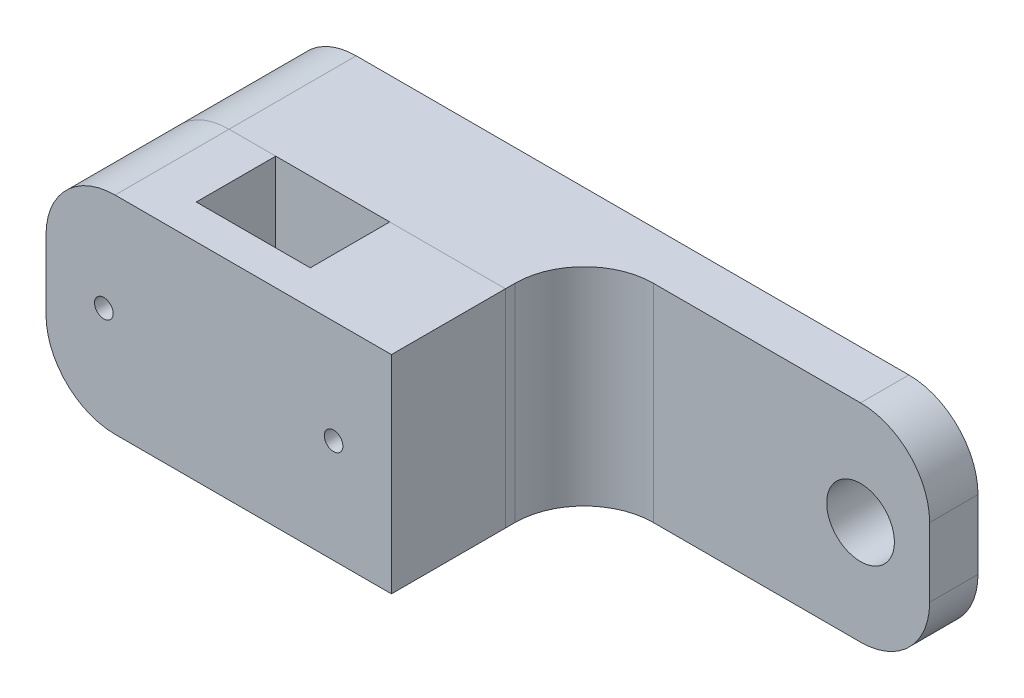
ISO-10303-21;
HEADER;
FILE_DESCRIPTION(('STEP AP214'),'2;1');
FILE_NAME('part.step','',(''),(''),'','','');
FILE_SCHEMA(('AUTOMOTIVE_DESIGN { 1 0 10303 214 1 1 1 1 }'));
ENDSEC;
DATA;
#1=APPLICATION_CONTEXT('core data for automotive mechanical design processes');
#2=APPLICATION_PROTOCOL_DEFINITION('international standard','automotive_design',2000,#1);
#3=PRODUCT_CONTEXT('',#1,'mechanical');
#4=PRODUCT('Part','Part','',(#3));
#5=PRODUCT_RELATED_PRODUCT_CATEGORY('part','',(#4));
#6=PRODUCT_DEFINITION_FORMATION('','',#4);
#7=PRODUCT_DEFINITION_CONTEXT('part definition',#1,'design');
#8=PRODUCT_DEFINITION('design','',#6,#7);
#9=PRODUCT_DEFINITION_SHAPE('','',#8);
#10=(LENGTH_UNIT() NAMED_UNIT(*) SI_UNIT(.MILLI.,.METRE.));
#11=(NAMED_UNIT(*) PLANE_ANGLE_UNIT() SI_UNIT($,.RADIAN.));
#12=(NAMED_UNIT(*) SI_UNIT($,.STERADIAN.) SOLID_ANGLE_UNIT());
#13=UNCERTAINTY_MEASURE_WITH_UNIT(LENGTH_MEASURE(1.E-05),#10,'distance_accuracy_value','');
#14=(GEOMETRIC_REPRESENTATION_CONTEXT(3) GLOBAL_UNCERTAINTY_ASSIGNED_CONTEXT((#13)) GLOBAL_UNIT_ASSIGNED_CONTEXT((#10,
#11,#12)) REPRESENTATION_CONTEXT('',''));
#15=CARTESIAN_POINT('',(0.,0.,0.));
#16=DIRECTION('',(0.,0.,1.));
#17=DIRECTION('',(1.,0.,0.));
#18=AXIS2_PLACEMENT_3D('',#15,#16,#17);
#19=CARTESIAN_POINT('',(16.75,0.,29.9));
#20=DIRECTION('',(1.,0.,0.));
#21=DIRECTION('',(0.,0.,-1.));
#22=AXIS2_PLACEMENT_3D('',#19,#20,#21);
#23=PLANE('',#22);
#24=DIRECTION('',(0.,-1.,0.));
#25=VECTOR('',#24,1.);
#26=CARTESIAN_POINT('',(16.75,0.,18.4));
#27=LINE('',#26,#25);
#28=CARTESIAN_POINT('',(16.75,30.,18.4));
#29=VERTEX_POINT('',#28);
#30=CARTESIAN_POINT('',(16.75,0.,18.4));
#31=VERTEX_POINT('',#30);
#32=EDGE_CURVE('E177',#29,#31,#27,.T.);
#33=ORIENTED_EDGE('',*,*,#32,.F.);
#34=DIRECTION('',(0.,0.,-1.));
#35=VECTOR('',#34,1.);
#36=CARTESIAN_POINT('',(16.75,30.,29.9));
#37=LINE('',#36,#35);
#38=CARTESIAN_POINT('',(16.75,30.,29.9));
#39=VERTEX_POINT('',#38);
#40=EDGE_CURVE('E187',#39,#29,#37,.T.);
#41=ORIENTED_EDGE('',*,*,#40,.F.);
#42=DIRECTION('',(0.,-1.,0.));
#43=VECTOR('',#42,1.);
#44=CARTESIAN_POINT('',(16.75,0.,29.9));
#45=LINE('',#44,#43);
#46=CARTESIAN_POINT('',(16.75,0.,29.9));
#47=VERTEX_POINT('',#46);
#48=EDGE_CURVE('E172',#39,#47,#45,.T.);
#49=ORIENTED_EDGE('',*,*,#48,.T.);
#50=DIRECTION('',(0.,0.,-1.));
#51=VECTOR('',#50,1.);
#52=CARTESIAN_POINT('',(16.75,0.,29.9));
#53=LINE('',#52,#51);
#54=EDGE_CURVE('E155',#47,#31,#53,.T.);
#55=ORIENTED_EDGE('',*,*,#54,.T.);
#56=EDGE_LOOP('',(#33,#41,#49,#55));
#57=FACE_BOUND('',#56,.T.);
#58=ADVANCED_FACE('F51',(#57),#23,.T.);
#59=CARTESIAN_POINT('',(0.,30.,29.9));
#60=DIRECTION('',(0.,-1.,0.));
#61=DIRECTION('',(0.,0.,-1.));
#62=AXIS2_PLACEMENT_3D('',#59,#60,#61);
#63=PLANE('',#62);
#64=DIRECTION('',(-1.,0.,0.));
#65=VECTOR('',#64,1.);
#66=CARTESIAN_POINT('',(0.,30.,18.4));
#67=LINE('',#66,#65);
#68=CARTESIAN_POINT('',(10.,30.,18.4));
#69=VERTEX_POINT('',#68);
#70=EDGE_CURVE('E180',#29,#69,#67,.T.);
#71=ORIENTED_EDGE('',*,*,#70,.T.);
#72=DIRECTION('',(0.,0.,-1.));
#73=VECTOR('',#72,1.);
#74=CARTESIAN_POINT('',(10.,30.,29.9));
#75=LINE('',#74,#73);
#76=CARTESIAN_POINT('',(10.,30.,34.9));
#77=VERTEX_POINT('',#76);
#78=EDGE_CURVE('E74',#69,#77,#75,.F.);
#79=ORIENTED_EDGE('',*,*,#78,.T.);
#80=DIRECTION('',(-1.,0.,0.));
#81=VECTOR('',#80,1.);
#82=CARTESIAN_POINT('',(0.,30.,34.9));
#83=LINE('',#82,#81);
#84=CARTESIAN_POINT('',(50.,30.,34.9));
#85=VERTEX_POINT('',#84);
#86=EDGE_CURVE('E164',#85,#77,#83,.T.);
#87=ORIENTED_EDGE('',*,*,#86,.F.);
#88=DIRECTION('',(0.,0.,-1.));
#89=VECTOR('',#88,1.);
#90=CARTESIAN_POINT('',(50.,30.,34.9));
#91=LINE('',#90,#89);
#92=CARTESIAN_POINT('',(50.,30.,18.4));
#93=VERTEX_POINT('',#92);
#94=EDGE_CURVE('E167',#85,#93,#91,.T.);
#95=ORIENTED_EDGE('',*,*,#94,.T.);
#96=DIRECTION('',(-1.,0.,0.));
#97=VECTOR('',#96,1.);
#98=CARTESIAN_POINT('',(0.,30.,18.4));
#99=LINE('',#98,#97);
#100=CARTESIAN_POINT('',(33.25,30.,18.4));
#101=VERTEX_POINT('',#100);
#102=EDGE_CURVE('E151',#93,#101,#99,.T.);
#103=ORIENTED_EDGE('',*,*,#102,.T.);
#104=DIRECTION('',(0.,0.,-1.));
#105=VECTOR('',#104,1.);
#106=CARTESIAN_POINT('',(33.25,30.,29.9));
#107=LINE('',#106,#105);
#108=CARTESIAN_POINT('',(33.25,30.,29.9));
#109=VERTEX_POINT('',#108);
#110=EDGE_CURVE('E143',#109,#101,#107,.T.);
#111=ORIENTED_EDGE('',*,*,#110,.F.);
#112=DIRECTION('',(-1.,0.,0.));
#113=VECTOR('',#112,1.);
#114=CARTESIAN_POINT('',(0.,30.,29.9));
#115=LINE('',#114,#113);
#116=EDGE_CURVE('E150',#109,#39,#115,.T.);
#117=ORIENTED_EDGE('',*,*,#116,.T.);
#118=ORIENTED_EDGE('',*,*,#40,.T.);
#119=EDGE_LOOP('',(#71,#79,#87,#95,#103,#111,#117,#118));
#120=FACE_BOUND('',#119,.T.);
#121=ADVANCED_FACE('F216',(#120),#63,.F.);
#122=CARTESIAN_POINT('',(0.,0.,29.9));
#123=DIRECTION('',(1.,0.,0.));
#124=DIRECTION('',(0.,0.,-1.));
#125=AXIS2_PLACEMENT_3D('',#122,#123,#124);
#126=PLANE('',#125);
#127=DIRECTION('',(0.,-1.,0.));
#128=VECTOR('',#127,1.);
#129=CARTESIAN_POINT('',(0.,0.,34.9));
#130=LINE('',#129,#128);
#131=CARTESIAN_POINT('',(0.,20.,34.9));
#132=VERTEX_POINT('',#131);
#133=CARTESIAN_POINT('',(0.,10.,34.9));
#134=VERTEX_POINT('',#133);
#135=EDGE_CURVE('E159',#132,#134,#130,.T.);
#136=ORIENTED_EDGE('',*,*,#135,.F.);
#137=DIRECTION('',(0.,0.,-1.));
#138=VECTOR('',#137,1.);
#139=CARTESIAN_POINT('',(0.,20.,29.9));
#140=LINE('',#139,#138);
#141=CARTESIAN_POINT('',(0.,20.,18.4));
#142=VERTEX_POINT('',#141);
#143=EDGE_CURVE('E191',#132,#142,#140,.T.);
#144=ORIENTED_EDGE('',*,*,#143,.T.);
#145=DIRECTION('',(0.,-1.,0.));
#146=VECTOR('',#145,1.);
#147=CARTESIAN_POINT('',(0.,0.,18.4));
#148=LINE('',#147,#146);
#149=CARTESIAN_POINT('',(0.,10.,18.4));
#150=VERTEX_POINT('',#149);
#151=EDGE_CURVE('E182',#142,#150,#148,.T.);
#152=ORIENTED_EDGE('',*,*,#151,.T.);
#153=DIRECTION('',(0.,0.,-1.));
#154=VECTOR('',#153,1.);
#155=CARTESIAN_POINT('',(0.,10.,29.9));
#156=LINE('',#155,#154);
#157=EDGE_CURVE('E189',#150,#134,#156,.F.);
#158=ORIENTED_EDGE('',*,*,#157,.T.);
#159=EDGE_LOOP('',(#136,#144,#152,#158));
#160=FACE_BOUND('',#159,.T.);
#161=ADVANCED_FACE('F206',(#160),#126,.F.);
#162=CARTESIAN_POINT('',(8.375,15.,29.9));
#163=DIRECTION('',(0.,0.,-1.));
#164=DIRECTION('',(-1.,0.,0.));
#165=AXIS2_PLACEMENT_3D('',#162,#163,#164);
#166=CYLINDRICAL_SURFACE('',#165,1.35);
#167=CARTESIAN_POINT('',(8.375,15.,18.4));
#168=DIRECTION('',(0.,0.,1.));
#169=DIRECTION('',(1.,0.,0.));
#170=AXIS2_PLACEMENT_3D('',#167,#168,#169);
#171=CIRCLE('',#170,1.35);
#172=CARTESIAN_POINT('',(9.725,15.,18.4));
#173=VERTEX_POINT('',#172);
#174=EDGE_CURVE('E171',#173,#173,#171,.T.);
#175=ORIENTED_EDGE('',*,*,#174,.F.);
#176=EDGE_LOOP('',(#175));
#177=FACE_BOUND('',#176,.T.);
#178=CARTESIAN_POINT('',(8.375,15.,34.9));
#179=DIRECTION('',(0.,0.,1.));
#180=DIRECTION('',(1.,0.,0.));
#181=AXIS2_PLACEMENT_3D('',#178,#179,#180);
#182=CIRCLE('',#181,1.35);
#183=CARTESIAN_POINT('',(9.725,15.,34.9));
#184=VERTEX_POINT('',#183);
#185=EDGE_CURVE('E157',#184,#184,#182,.T.);
#186=ORIENTED_EDGE('',*,*,#185,.T.);
#187=EDGE_LOOP('',(#186));
#188=FACE_BOUND('',#187,.T.);
#189=ADVANCED_FACE('F236',(#177,#188),#166,.F.);
#190=CARTESIAN_POINT('',(0.,0.,29.9));
#191=DIRECTION('',(0.,1.,0.));
#192=DIRECTION('',(0.,0.,1.));
#193=AXIS2_PLACEMENT_3D('',#190,#191,#192);
#194=PLANE('',#193);
#195=DIRECTION('',(1.,0.,0.));
#196=VECTOR('',#195,1.);
#197=CARTESIAN_POINT('',(0.,0.,34.9));
#198=LINE('',#197,#196);
#199=CARTESIAN_POINT('',(10.,0.,34.9));
#200=VERTEX_POINT('',#199);
#201=CARTESIAN_POINT('',(50.,0.,34.9));
#202=VERTEX_POINT('',#201);
#203=EDGE_CURVE('E209',#200,#202,#198,.T.);
#204=ORIENTED_EDGE('',*,*,#203,.F.);
#205=DIRECTION('',(0.,0.,-1.));
#206=VECTOR('',#205,1.);
#207=CARTESIAN_POINT('',(10.,0.,29.9));
#208=LINE('',#207,#206);
#209=CARTESIAN_POINT('',(10.,0.,18.4));
#210=VERTEX_POINT('',#209);
#211=EDGE_CURVE('E12',#200,#210,#208,.T.);
#212=ORIENTED_EDGE('',*,*,#211,.T.);
#213=DIRECTION('',(1.,0.,0.));
#214=VECTOR('',#213,1.);
#215=CARTESIAN_POINT('',(0.,0.,18.4));
#216=LINE('',#215,#214);
#217=EDGE_CURVE('E174',#210,#31,#216,.T.);
#218=ORIENTED_EDGE('',*,*,#217,.T.);
#219=ORIENTED_EDGE('',*,*,#54,.F.);
#220=DIRECTION('',(1.,0.,0.));
#221=VECTOR('',#220,1.);
#222=CARTESIAN_POINT('',(0.,0.,29.9));
#223=LINE('',#222,#221);
#224=CARTESIAN_POINT('',(33.25,0.,29.9));
#225=VERTEX_POINT('',#224);
#226=EDGE_CURVE('E148',#47,#225,#223,.T.);
#227=ORIENTED_EDGE('',*,*,#226,.T.);
#228=DIRECTION('',(0.,0.,-1.));
#229=VECTOR('',#228,1.);
#230=CARTESIAN_POINT('',(33.25,0.,29.9));
#231=LINE('',#230,#229);
#232=CARTESIAN_POINT('',(33.25,0.,18.4));
#233=VERTEX_POINT('',#232);
#234=EDGE_CURVE('E131',#225,#233,#231,.T.);
#235=ORIENTED_EDGE('',*,*,#234,.T.);
#236=DIRECTION('',(1.,0.,0.));
#237=VECTOR('',#236,1.);
#238=CARTESIAN_POINT('',(0.,0.,18.4));
#239=LINE('',#238,#237);
#240=CARTESIAN_POINT('',(50.,0.,18.4));
#241=VERTEX_POINT('',#240);
#242=EDGE_CURVE('E268',#233,#241,#239,.T.);
#243=ORIENTED_EDGE('',*,*,#242,.T.);
#244=DIRECTION('',(0.,0.,-1.));
#245=VECTOR('',#244,1.);
#246=CARTESIAN_POINT('',(50.,0.,34.9));
#247=LINE('',#246,#245);
#248=EDGE_CURVE('E169',#202,#241,#247,.T.);
#249=ORIENTED_EDGE('',*,*,#248,.F.);
#250=EDGE_LOOP('',(#204,#212,#218,#219,#227,#235,#243,#249));
#251=FACE_BOUND('',#250,.T.);
#252=ADVANCED_FACE('F153',(#251),#194,.F.);
#253=CARTESIAN_POINT('',(0.,0.,18.4));
#254=DIRECTION('',(0.,0.,1.));
#255=DIRECTION('',(1.,0.,0.));
#256=AXIS2_PLACEMENT_3D('',#253,#254,#255);
#257=PLANE('',#256);
#258=ORIENTED_EDGE('',*,*,#174,.T.);
#259=EDGE_LOOP('',(#258));
#260=FACE_BOUND('',#259,.T.);
#261=ORIENTED_EDGE('',*,*,#151,.F.);
#262=CARTESIAN_POINT('',(10.,20.,18.4));
#263=DIRECTION('',(0.,0.,1.));
#264=DIRECTION('',(1.,0.,0.));
#265=AXIS2_PLACEMENT_3D('',#262,#263,#264);
#266=CIRCLE('',#265,10.);
#267=EDGE_CURVE('E196',#142,#69,#266,.F.);
#268=ORIENTED_EDGE('',*,*,#267,.T.);
#269=ORIENTED_EDGE('',*,*,#70,.F.);
#270=ORIENTED_EDGE('',*,*,#32,.T.);
#271=ORIENTED_EDGE('',*,*,#217,.F.);
#272=CARTESIAN_POINT('',(10.,10.,18.4));
#273=DIRECTION('',(0.,0.,1.));
#274=DIRECTION('',(1.,0.,0.));
#275=AXIS2_PLACEMENT_3D('',#272,#273,#274);
#276=CIRCLE('',#275,10.);
#277=EDGE_CURVE('E194',#210,#150,#276,.F.);
#278=ORIENTED_EDGE('',*,*,#277,.T.);
#279=EDGE_LOOP('',(#261,#268,#269,#270,#271,#278));
#280=FACE_BOUND('',#279,.T.);
#281=ADVANCED_FACE('F214',(#260,#280),#257,.F.);
#282=CARTESIAN_POINT('',(0.,0.,29.9));
#283=DIRECTION('',(0.,0.,-1.));
#284=DIRECTION('',(-1.,0.,0.));
#285=AXIS2_PLACEMENT_3D('',#282,#283,#284);
#286=PLANE('',#285);
#287=DIRECTION('',(0.,1.,0.));
#288=VECTOR('',#287,1.);
#289=CARTESIAN_POINT('',(33.25,0.,29.9));
#290=LINE('',#289,#288);
#291=EDGE_CURVE('E134',#225,#109,#290,.T.);
#292=ORIENTED_EDGE('',*,*,#291,.F.);
#293=ORIENTED_EDGE('',*,*,#226,.F.);
#294=ORIENTED_EDGE('',*,*,#48,.F.);
#295=ORIENTED_EDGE('',*,*,#116,.F.);
#296=EDGE_LOOP('',(#292,#293,#294,#295));
#297=FACE_BOUND('',#296,.T.);
#298=ADVANCED_FACE('F146',(#297),#286,.T.);
#299=CARTESIAN_POINT('',(0.,0.,34.9));
#300=DIRECTION('',(0.,0.,-1.));
#301=DIRECTION('',(-1.,0.,0.));
#302=AXIS2_PLACEMENT_3D('',#299,#300,#301);
#303=PLANE('',#302);
#304=ORIENTED_EDGE('',*,*,#86,.T.);
#305=CARTESIAN_POINT('',(10.,20.,34.9));
#306=DIRECTION('',(0.,0.,-1.));
#307=DIRECTION('',(-1.,0.,0.));
#308=AXIS2_PLACEMENT_3D('',#305,#306,#307);
#309=CIRCLE('',#308,10.);
#310=EDGE_CURVE('E59',#77,#132,#309,.F.);
#311=ORIENTED_EDGE('',*,*,#310,.T.);
#312=ORIENTED_EDGE('',*,*,#135,.T.);
#313=CARTESIAN_POINT('',(10.,10.,34.9));
#314=DIRECTION('',(0.,0.,-1.));
#315=DIRECTION('',(-1.,0.,0.));
#316=AXIS2_PLACEMENT_3D('',#313,#314,#315);
#317=CIRCLE('',#316,10.);
#318=EDGE_CURVE('E66',#134,#200,#317,.F.);
#319=ORIENTED_EDGE('',*,*,#318,.T.);
#320=ORIENTED_EDGE('',*,*,#203,.T.);
#321=DIRECTION('',(0.,1.,0.));
#322=VECTOR('',#321,1.);
#323=CARTESIAN_POINT('',(50.,0.,34.9));
#324=LINE('',#323,#322);
#325=EDGE_CURVE('E257',#202,#85,#324,.T.);
#326=ORIENTED_EDGE('',*,*,#325,.T.);
#327=EDGE_LOOP('',(#304,#311,#312,#319,#320,#326));
#328=FACE_BOUND('',#327,.T.);
#329=ORIENTED_EDGE('',*,*,#185,.F.);
#330=EDGE_LOOP('',(#329));
#331=FACE_BOUND('',#330,.T.);
#332=CARTESIAN_POINT('',(41.625,15.,34.9));
#333=DIRECTION('',(0.,0.,1.));
#334=DIRECTION('',(1.,0.,0.));
#335=AXIS2_PLACEMENT_3D('',#332,#333,#334);
#336=CIRCLE('',#335,1.35);
#337=CARTESIAN_POINT('',(42.975,15.,34.9));
#338=VERTEX_POINT('',#337);
#339=EDGE_CURVE('E142',#338,#338,#336,.T.);
#340=ORIENTED_EDGE('',*,*,#339,.F.);
#341=EDGE_LOOP('',(#340));
#342=FACE_BOUND('',#341,.T.);
#343=ADVANCED_FACE('F201',(#328,#331,#342),#303,.F.);
#344=CARTESIAN_POINT('',(50.,0.,34.9));
#345=DIRECTION('',(-1.,0.,0.));
#346=DIRECTION('',(0.,0.,1.));
#347=AXIS2_PLACEMENT_3D('',#344,#345,#346);
#348=PLANE('',#347);
#349=ORIENTED_EDGE('',*,*,#248,.T.);
#350=DIRECTION('',(0.,1.,0.));
#351=VECTOR('',#350,1.);
#352=CARTESIAN_POINT('',(50.,0.,18.4));
#353=LINE('',#352,#351);
#354=EDGE_CURVE('E263',#241,#93,#353,.T.);
#355=ORIENTED_EDGE('',*,*,#354,.T.);
#356=ORIENTED_EDGE('',*,*,#94,.F.);
#357=ORIENTED_EDGE('',*,*,#325,.F.);
#358=EDGE_LOOP('',(#349,#355,#356,#357));
#359=FACE_BOUND('',#358,.T.);
#360=ADVANCED_FACE('F249',(#359),#348,.F.);
#361=CARTESIAN_POINT('',(41.625,15.,34.9));
#362=DIRECTION('',(0.,0.,-1.));
#363=DIRECTION('',(-1.,0.,0.));
#364=AXIS2_PLACEMENT_3D('',#361,#362,#363);
#365=CYLINDRICAL_SURFACE('',#364,1.35);
#366=ORIENTED_EDGE('',*,*,#339,.T.);
#367=EDGE_LOOP('',(#366));
#368=FACE_BOUND('',#367,.T.);
#369=CARTESIAN_POINT('',(41.625,15.,18.4));
#370=DIRECTION('',(0.,0.,1.));
#371=DIRECTION('',(1.,0.,0.));
#372=AXIS2_PLACEMENT_3D('',#369,#370,#371);
#373=CIRCLE('',#372,1.35);
#374=CARTESIAN_POINT('',(42.975,15.,18.4));
#375=VERTEX_POINT('',#374);
#376=EDGE_CURVE('E273',#375,#375,#373,.T.);
#377=ORIENTED_EDGE('',*,*,#376,.F.);
#378=EDGE_LOOP('',(#377));
#379=FACE_BOUND('',#378,.T.);
#380=ADVANCED_FACE('F278',(#368,#379),#365,.F.);
#381=CARTESIAN_POINT('',(33.25,0.,29.9));
#382=DIRECTION('',(-1.,0.,0.));
#383=DIRECTION('',(0.,0.,1.));
#384=AXIS2_PLACEMENT_3D('',#381,#382,#383);
#385=PLANE('',#384);
#386=DIRECTION('',(0.,1.,0.));
#387=VECTOR('',#386,1.);
#388=CARTESIAN_POINT('',(33.25,0.,18.4));
#389=LINE('',#388,#387);
#390=EDGE_CURVE('E137',#233,#101,#389,.T.);
#391=ORIENTED_EDGE('',*,*,#390,.F.);
#392=ORIENTED_EDGE('',*,*,#234,.F.);
#393=ORIENTED_EDGE('',*,*,#291,.T.);
#394=ORIENTED_EDGE('',*,*,#110,.T.);
#395=EDGE_LOOP('',(#391,#392,#393,#394));
#396=FACE_BOUND('',#395,.T.);
#397=ADVANCED_FACE('F133',(#396),#385,.T.);
#398=CARTESIAN_POINT('',(0.,0.,18.4));
#399=DIRECTION('',(0.,0.,1.));
#400=DIRECTION('',(1.,0.,0.));
#401=AXIS2_PLACEMENT_3D('',#398,#399,#400);
#402=PLANE('',#401);
#403=ORIENTED_EDGE('',*,*,#376,.T.);
#404=EDGE_LOOP('',(#403));
#405=FACE_BOUND('',#404,.T.);
#406=ORIENTED_EDGE('',*,*,#390,.T.);
#407=ORIENTED_EDGE('',*,*,#102,.F.);
#408=ORIENTED_EDGE('',*,*,#354,.F.);
#409=ORIENTED_EDGE('',*,*,#242,.F.);
#410=EDGE_LOOP('',(#406,#407,#408,#409));
#411=FACE_BOUND('',#410,.T.);
#412=ADVANCED_FACE('F227',(#405,#411),#402,.F.);
#413=CARTESIAN_POINT('',(10.,20.,29.9));
#414=DIRECTION('',(0.,0.,-1.));
#415=DIRECTION('',(-1.,0.,0.));
#416=AXIS2_PLACEMENT_3D('',#413,#414,#415);
#417=CYLINDRICAL_SURFACE('',#416,10.);
#418=ORIENTED_EDGE('',*,*,#310,.F.);
#419=ORIENTED_EDGE('',*,*,#78,.F.);
#420=ORIENTED_EDGE('',*,*,#267,.F.);
#421=ORIENTED_EDGE('',*,*,#143,.F.);
#422=EDGE_LOOP('',(#418,#419,#420,#421));
#423=FACE_BOUND('',#422,.T.);
#424=ADVANCED_FACE('F211',(#423),#417,.T.);
#425=CARTESIAN_POINT('',(10.,10.,29.9));
#426=DIRECTION('',(0.,0.,-1.));
#427=DIRECTION('',(-1.,0.,0.));
#428=AXIS2_PLACEMENT_3D('',#425,#426,#427);
#429=CYLINDRICAL_SURFACE('',#428,10.);
#430=ORIENTED_EDGE('',*,*,#318,.F.);
#431=ORIENTED_EDGE('',*,*,#157,.F.);
#432=ORIENTED_EDGE('',*,*,#277,.F.);
#433=ORIENTED_EDGE('',*,*,#211,.F.);
#434=EDGE_LOOP('',(#430,#431,#432,#433));
#435=FACE_BOUND('',#434,.T.);
#436=ADVANCED_FACE('F53',(#435),#429,.T.);
#437=CLOSED_SHELL('',(#58,#121,#161,#189,#252,#281,#298,#343,#360,#380,#397,#412,#424,#436));
#438=MANIFOLD_SOLID_BREP('B2',#437);
#439=CARTESIAN_POINT('',(0.,30.,18.4));
#440=DIRECTION('',(0.,1.,0.));
#441=DIRECTION('',(0.,0.,1.));
#442=AXIS2_PLACEMENT_3D('',#439,#440,#441);
#443=PLANE('',#442);
#444=DIRECTION('',(1.,0.,0.));
#445=VECTOR('',#444,1.);
#446=CARTESIAN_POINT('',(0.,30.,0.));
#447=LINE('',#446,#445);
#448=CARTESIAN_POINT('',(10.,30.,0.));
#449=VERTEX_POINT('',#448);
#450=CARTESIAN_POINT('',(90.,30.,0.));
#451=VERTEX_POINT('',#450);
#452=EDGE_CURVE('E536',#449,#451,#447,.T.);
#453=ORIENTED_EDGE('',*,*,#452,.F.);
#454=DIRECTION('',(0.,0.,-1.));
#455=VECTOR('',#454,1.);
#456=CARTESIAN_POINT('',(10.,30.,18.4));
#457=LINE('',#456,#455);
#458=CARTESIAN_POINT('',(10.,30.,18.4));
#459=VERTEX_POINT('',#458);
#460=EDGE_CURVE('E582',#449,#459,#457,.F.);
#461=ORIENTED_EDGE('',*,*,#460,.T.);
#462=DIRECTION('',(1.,0.,0.));
#463=VECTOR('',#462,1.);
#464=CARTESIAN_POINT('',(0.,30.,18.4));
#465=LINE('',#464,#463);
#466=CARTESIAN_POINT('',(50.,30.,18.4));
#467=VERTEX_POINT('',#466);
#468=EDGE_CURVE('E548',#459,#467,#465,.T.);
#469=ORIENTED_EDGE('',*,*,#468,.T.);
#470=DIRECTION('',(0.,0.,-1.));
#471=VECTOR('',#470,1.);
#472=CARTESIAN_POINT('',(50.,30.,18.4));
#473=LINE('',#472,#471);
#474=CARTESIAN_POINT('',(50.,30.,17.));
#475=VERTEX_POINT('',#474);
#476=EDGE_CURVE('E526',#467,#475,#473,.T.);
#477=ORIENTED_EDGE('',*,*,#476,.T.);
#478=CARTESIAN_POINT('',(60.,30.,17.));
#479=DIRECTION('',(0.,1.,0.));
#480=DIRECTION('',(0.,0.,1.));
#481=AXIS2_PLACEMENT_3D('',#478,#479,#480);
#482=CIRCLE('',#481,10.);
#483=CARTESIAN_POINT('',(60.,30.,7.));
#484=VERTEX_POINT('',#483);
#485=EDGE_CURVE('E424',#475,#484,#482,.F.);
#486=ORIENTED_EDGE('',*,*,#485,.T.);
#487=DIRECTION('',(1.,0.,0.));
#488=VECTOR('',#487,1.);
#489=CARTESIAN_POINT('',(0.,30.,7.));
#490=LINE('',#489,#488);
#491=CARTESIAN_POINT('',(90.,30.,7.));
#492=VERTEX_POINT('',#491);
#493=EDGE_CURVE('E541',#484,#492,#490,.T.);
#494=ORIENTED_EDGE('',*,*,#493,.T.);
#495=DIRECTION('',(0.,0.,-1.));
#496=VECTOR('',#495,1.);
#497=CARTESIAN_POINT('',(90.,30.,0.));
#498=LINE('',#497,#496);
#499=EDGE_CURVE('E578',#492,#451,#498,.T.);
#500=ORIENTED_EDGE('',*,*,#499,.T.);
#501=EDGE_LOOP('',(#453,#461,#469,#477,#486,#494,#500));
#502=FACE_BOUND('',#501,.T.);
#503=ADVANCED_FACE('F415',(#502),#443,.T.);
#504=CARTESIAN_POINT('',(0.,0.,18.4));
#505=DIRECTION('',(-1.,0.,0.));
#506=DIRECTION('',(0.,0.,1.));
#507=AXIS2_PLACEMENT_3D('',#504,#505,#506);
#508=PLANE('',#507);
#509=DIRECTION('',(0.,1.,0.));
#510=VECTOR('',#509,1.);
#511=CARTESIAN_POINT('',(0.,0.,18.4));
#512=LINE('',#511,#510);
#513=CARTESIAN_POINT('',(0.,10.,18.4));
#514=VERTEX_POINT('',#513);
#515=CARTESIAN_POINT('',(0.,20.,18.4));
#516=VERTEX_POINT('',#515);
#517=EDGE_CURVE('E514',#514,#516,#512,.T.);
#518=ORIENTED_EDGE('',*,*,#517,.T.);
#519=DIRECTION('',(0.,0.,-1.));
#520=VECTOR('',#519,1.);
#521=CARTESIAN_POINT('',(0.,20.,18.4));
#522=LINE('',#521,#520);
#523=CARTESIAN_POINT('',(0.,20.,0.));
#524=VERTEX_POINT('',#523);
#525=EDGE_CURVE('E562',#516,#524,#522,.T.);
#526=ORIENTED_EDGE('',*,*,#525,.T.);
#527=DIRECTION('',(0.,1.,0.));
#528=VECTOR('',#527,1.);
#529=CARTESIAN_POINT('',(0.,0.,0.));
#530=LINE('',#529,#528);
#531=CARTESIAN_POINT('',(0.,10.,0.));
#532=VERTEX_POINT('',#531);
#533=EDGE_CURVE('E540',#532,#524,#530,.T.);
#534=ORIENTED_EDGE('',*,*,#533,.F.);
#535=DIRECTION('',(0.,0.,-1.));
#536=VECTOR('',#535,1.);
#537=CARTESIAN_POINT('',(0.,10.,18.4));
#538=LINE('',#537,#536);
#539=EDGE_CURVE('E525',#532,#514,#538,.F.);
#540=ORIENTED_EDGE('',*,*,#539,.T.);
#541=EDGE_LOOP('',(#518,#526,#534,#540));
#542=FACE_BOUND('',#541,.T.);
#543=ADVANCED_FACE('F633',(#542),#508,.T.);
#544=CARTESIAN_POINT('',(0.,0.,18.4));
#545=DIRECTION('',(0.,1.,0.));
#546=DIRECTION('',(0.,0.,1.));
#547=AXIS2_PLACEMENT_3D('',#544,#545,#546);
#548=PLANE('',#547);
#549=DIRECTION('',(1.,0.,0.));
#550=VECTOR('',#549,1.);
#551=CARTESIAN_POINT('',(0.,0.,18.4));
#552=LINE('',#551,#550);
#553=CARTESIAN_POINT('',(10.,0.,18.4));
#554=VERTEX_POINT('',#553);
#555=CARTESIAN_POINT('',(50.,0.,18.4));
#556=VERTEX_POINT('',#555);
#557=EDGE_CURVE('E500',#554,#556,#552,.T.);
#558=ORIENTED_EDGE('',*,*,#557,.F.);
#559=DIRECTION('',(0.,0.,-1.));
#560=VECTOR('',#559,1.);
#561=CARTESIAN_POINT('',(10.,0.,0.));
#562=LINE('',#561,#560);
#563=CARTESIAN_POINT('',(10.,0.,0.));
#564=VERTEX_POINT('',#563);
#565=EDGE_CURVE('E593',#554,#564,#562,.T.);
#566=ORIENTED_EDGE('',*,*,#565,.T.);
#567=DIRECTION('',(1.,0.,0.));
#568=VECTOR('',#567,1.);
#569=CARTESIAN_POINT('',(0.,0.,0.));
#570=LINE('',#569,#568);
#571=CARTESIAN_POINT('',(90.,0.,0.));
#572=VERTEX_POINT('',#571);
#573=EDGE_CURVE('E545',#564,#572,#570,.T.);
#574=ORIENTED_EDGE('',*,*,#573,.T.);
#575=DIRECTION('',(0.,0.,-1.));
#576=VECTOR('',#575,1.);
#577=CARTESIAN_POINT('',(90.,0.,18.4));
#578=LINE('',#577,#576);
#579=CARTESIAN_POINT('',(90.,0.,7.));
#580=VERTEX_POINT('',#579);
#581=EDGE_CURVE('E590',#572,#580,#578,.F.);
#582=ORIENTED_EDGE('',*,*,#581,.T.);
#583=DIRECTION('',(1.,0.,0.));
#584=VECTOR('',#583,1.);
#585=CARTESIAN_POINT('',(0.,0.,7.));
#586=LINE('',#585,#584);
#587=CARTESIAN_POINT('',(60.,0.,7.));
#588=VERTEX_POINT('',#587);
#589=EDGE_CURVE('E678',#588,#580,#586,.T.);
#590=ORIENTED_EDGE('',*,*,#589,.F.);
#591=CARTESIAN_POINT('',(60.,0.,17.));
#592=DIRECTION('',(0.,1.,0.));
#593=DIRECTION('',(0.,0.,1.));
#594=AXIS2_PLACEMENT_3D('',#591,#592,#593);
#595=CIRCLE('',#594,10.);
#596=CARTESIAN_POINT('',(50.,0.,17.));
#597=VERTEX_POINT('',#596);
#598=EDGE_CURVE('E49',#588,#597,#595,.T.);
#599=ORIENTED_EDGE('',*,*,#598,.T.);
#600=DIRECTION('',(0.,0.,-1.));
#601=VECTOR('',#600,1.);
#602=CARTESIAN_POINT('',(50.,0.,18.4));
#603=LINE('',#602,#601);
#604=EDGE_CURVE('E517',#556,#597,#603,.T.);
#605=ORIENTED_EDGE('',*,*,#604,.F.);
#606=EDGE_LOOP('',(#558,#566,#574,#582,#590,#599,#605));
#607=FACE_BOUND('',#606,.T.);
#608=ADVANCED_FACE('F518',(#607),#548,.F.);
#609=CARTESIAN_POINT('',(50.,0.,18.4));
#610=DIRECTION('',(-1.,0.,0.));
#611=DIRECTION('',(0.,0.,1.));
#612=AXIS2_PLACEMENT_3D('',#609,#610,#611);
#613=PLANE('',#612);
#614=ORIENTED_EDGE('',*,*,#604,.T.);
#615=DIRECTION('',(0.,1.,0.));
#616=VECTOR('',#615,1.);
#617=CARTESIAN_POINT('',(50.,0.,17.));
#618=LINE('',#617,#616);
#619=EDGE_CURVE('E610',#597,#475,#618,.T.);
#620=ORIENTED_EDGE('',*,*,#619,.T.);
#621=ORIENTED_EDGE('',*,*,#476,.F.);
#622=DIRECTION('',(0.,1.,0.));
#623=VECTOR('',#622,1.);
#624=CARTESIAN_POINT('',(50.,0.,18.4));
#625=LINE('',#624,#623);
#626=EDGE_CURVE('E505',#556,#467,#625,.T.);
#627=ORIENTED_EDGE('',*,*,#626,.F.);
#628=EDGE_LOOP('',(#614,#620,#621,#627));
#629=FACE_BOUND('',#628,.T.);
#630=ADVANCED_FACE('F528',(#629),#613,.F.);
#631=CARTESIAN_POINT('',(0.,0.,18.4));
#632=DIRECTION('',(0.,0.,1.));
#633=DIRECTION('',(1.,0.,0.));
#634=AXIS2_PLACEMENT_3D('',#631,#632,#633);
#635=PLANE('',#634);
#636=CARTESIAN_POINT('',(8.375,15.,18.4));
#637=DIRECTION('',(0.,0.,1.));
#638=DIRECTION('',(1.,0.,0.));
#639=AXIS2_PLACEMENT_3D('',#636,#637,#638);
#640=CIRCLE('',#639,1.35);
#641=CARTESIAN_POINT('',(9.725,15.,18.4));
#642=VERTEX_POINT('',#641);
#643=EDGE_CURVE('E555',#642,#642,#640,.T.);
#644=ORIENTED_EDGE('',*,*,#643,.F.);
#645=EDGE_LOOP('',(#644));
#646=FACE_BOUND('',#645,.T.);
#647=CARTESIAN_POINT('',(41.625,15.,18.4));
#648=DIRECTION('',(0.,0.,1.));
#649=DIRECTION('',(1.,0.,0.));
#650=AXIS2_PLACEMENT_3D('',#647,#648,#649);
#651=CIRCLE('',#650,1.35);
#652=CARTESIAN_POINT('',(42.975,15.,18.4));
#653=VERTEX_POINT('',#652);
#654=EDGE_CURVE('E684',#653,#653,#651,.T.);
#655=ORIENTED_EDGE('',*,*,#654,.F.);
#656=EDGE_LOOP('',(#655));
#657=FACE_BOUND('',#656,.T.);
#658=ORIENTED_EDGE('',*,*,#468,.F.);
#659=CARTESIAN_POINT('',(10.,20.,18.4));
#660=DIRECTION('',(0.,0.,1.));
#661=DIRECTION('',(1.,0.,0.));
#662=AXIS2_PLACEMENT_3D('',#659,#660,#661);
#663=CIRCLE('',#662,10.);
#664=EDGE_CURVE('E587',#459,#516,#663,.T.);
#665=ORIENTED_EDGE('',*,*,#664,.T.);
#666=ORIENTED_EDGE('',*,*,#517,.F.);
#667=CARTESIAN_POINT('',(10.,10.,18.4));
#668=DIRECTION('',(0.,0.,1.));
#669=DIRECTION('',(1.,0.,0.));
#670=AXIS2_PLACEMENT_3D('',#667,#668,#669);
#671=CIRCLE('',#670,10.);
#672=EDGE_CURVE('E509',#514,#554,#671,.T.);
#673=ORIENTED_EDGE('',*,*,#672,.T.);
#674=ORIENTED_EDGE('',*,*,#557,.T.);
#675=ORIENTED_EDGE('',*,*,#626,.T.);
#676=EDGE_LOOP('',(#658,#665,#666,#673,#674,#675));
#677=FACE_BOUND('',#676,.T.);
#678=ADVANCED_FACE('F503',(#646,#657,#677),#635,.T.);
#679=CARTESIAN_POINT('',(0.,0.,0.));
#680=DIRECTION('',(0.,0.,1.));
#681=DIRECTION('',(1.,0.,0.));
#682=AXIS2_PLACEMENT_3D('',#679,#680,#681);
#683=PLANE('',#682);
#684=CARTESIAN_POINT('',(8.375,15.,0.));
#685=DIRECTION('',(0.,0.,1.));
#686=DIRECTION('',(1.,0.,0.));
#687=AXIS2_PLACEMENT_3D('',#684,#685,#686);
#688=CIRCLE('',#687,1.35);
#689=CARTESIAN_POINT('',(9.725,15.,0.));
#690=VERTEX_POINT('',#689);
#691=EDGE_CURVE('E554',#690,#690,#688,.T.);
#692=ORIENTED_EDGE('',*,*,#691,.T.);
#693=EDGE_LOOP('',(#692));
#694=FACE_BOUND('',#693,.T.);
#695=CARTESIAN_POINT('',(41.625,15.,0.));
#696=DIRECTION('',(0.,0.,1.));
#697=DIRECTION('',(1.,0.,0.));
#698=AXIS2_PLACEMENT_3D('',#695,#696,#697);
#699=CIRCLE('',#698,1.35);
#700=CARTESIAN_POINT('',(42.975,15.,0.));
#701=VERTEX_POINT('',#700);
#702=EDGE_CURVE('E550',#701,#701,#699,.T.);
#703=ORIENTED_EDGE('',*,*,#702,.T.);
#704=EDGE_LOOP('',(#703));
#705=FACE_BOUND('',#704,.T.);
#706=ORIENTED_EDGE('',*,*,#533,.T.);
#707=CARTESIAN_POINT('',(10.,20.,0.));
#708=DIRECTION('',(0.,0.,1.));
#709=DIRECTION('',(1.,0.,0.));
#710=AXIS2_PLACEMENT_3D('',#707,#708,#709);
#711=CIRCLE('',#710,10.);
#712=EDGE_CURVE('E575',#524,#449,#711,.F.);
#713=ORIENTED_EDGE('',*,*,#712,.T.);
#714=ORIENTED_EDGE('',*,*,#452,.T.);
#715=CARTESIAN_POINT('',(90.,20.,0.));
#716=DIRECTION('',(0.,0.,1.));
#717=DIRECTION('',(1.,0.,0.));
#718=AXIS2_PLACEMENT_3D('',#715,#716,#717);
#719=CIRCLE('',#718,10.);
#720=CARTESIAN_POINT('',(100.,20.,0.));
#721=VERTEX_POINT('',#720);
#722=EDGE_CURVE('E569',#451,#721,#719,.F.);
#723=ORIENTED_EDGE('',*,*,#722,.T.);
#724=DIRECTION('',(0.,1.,0.));
#725=VECTOR('',#724,1.);
#726=CARTESIAN_POINT('',(100.,0.,0.));
#727=LINE('',#726,#725);
#728=CARTESIAN_POINT('',(100.,10.,0.));
#729=VERTEX_POINT('',#728);
#730=EDGE_CURVE('E669',#729,#721,#727,.T.);
#731=ORIENTED_EDGE('',*,*,#730,.F.);
#732=CARTESIAN_POINT('',(90.,10.,0.));
#733=DIRECTION('',(0.,0.,1.));
#734=DIRECTION('',(1.,0.,0.));
#735=AXIS2_PLACEMENT_3D('',#732,#733,#734);
#736=CIRCLE('',#735,10.);
#737=EDGE_CURVE('E566',#729,#572,#736,.F.);
#738=ORIENTED_EDGE('',*,*,#737,.T.);
#739=ORIENTED_EDGE('',*,*,#573,.F.);
#740=CARTESIAN_POINT('',(10.,10.,0.));
#741=DIRECTION('',(0.,0.,1.));
#742=DIRECTION('',(1.,0.,0.));
#743=AXIS2_PLACEMENT_3D('',#740,#741,#742);
#744=CIRCLE('',#743,10.);
#745=EDGE_CURVE('E572',#564,#532,#744,.F.);
#746=ORIENTED_EDGE('',*,*,#745,.T.);
#747=EDGE_LOOP('',(#706,#713,#714,#723,#731,#738,#739,#746));
#748=FACE_BOUND('',#747,.T.);
#749=CARTESIAN_POINT('',(90.,15.,0.));
#750=DIRECTION('',(0.,0.,1.));
#751=DIRECTION('',(1.,0.,0.));
#752=AXIS2_PLACEMENT_3D('',#749,#750,#751);
#753=CIRCLE('',#752,4.9);
#754=CARTESIAN_POINT('',(94.9,15.,0.));
#755=VERTEX_POINT('',#754);
#756=EDGE_CURVE('E559',#755,#755,#753,.T.);
#757=ORIENTED_EDGE('',*,*,#756,.T.);
#758=EDGE_LOOP('',(#757));
#759=FACE_BOUND('',#758,.T.);
#760=ADVANCED_FACE('F657',(#694,#705,#748,#759),#683,.F.);
#761=CARTESIAN_POINT('',(100.,0.,7.));
#762=DIRECTION('',(-1.,0.,0.));
#763=DIRECTION('',(0.,0.,1.));
#764=AXIS2_PLACEMENT_3D('',#761,#762,#763);
#765=PLANE('',#764);
#766=ORIENTED_EDGE('',*,*,#730,.T.);
#767=DIRECTION('',(0.,0.,-1.));
#768=VECTOR('',#767,1.);
#769=CARTESIAN_POINT('',(100.,20.,7.));
#770=LINE('',#769,#768);
#771=CARTESIAN_POINT('',(100.,20.,7.));
#772=VERTEX_POINT('',#771);
#773=EDGE_CURVE('E431',#721,#772,#770,.F.);
#774=ORIENTED_EDGE('',*,*,#773,.T.);
#775=DIRECTION('',(0.,1.,0.));
#776=VECTOR('',#775,1.);
#777=CARTESIAN_POINT('',(100.,0.,7.));
#778=LINE('',#777,#776);
#779=CARTESIAN_POINT('',(100.,10.,7.));
#780=VERTEX_POINT('',#779);
#781=EDGE_CURVE('E623',#780,#772,#778,.T.);
#782=ORIENTED_EDGE('',*,*,#781,.F.);
#783=DIRECTION('',(0.,0.,-1.));
#784=VECTOR('',#783,1.);
#785=CARTESIAN_POINT('',(100.,10.,7.));
#786=LINE('',#785,#784);
#787=EDGE_CURVE('E596',#780,#729,#786,.T.);
#788=ORIENTED_EDGE('',*,*,#787,.T.);
#789=EDGE_LOOP('',(#766,#774,#782,#788));
#790=FACE_BOUND('',#789,.T.);
#791=ADVANCED_FACE('F706',(#790),#765,.F.);
#792=CARTESIAN_POINT('',(90.,15.,7.));
#793=DIRECTION('',(0.,0.,-1.));
#794=DIRECTION('',(-1.,0.,0.));
#795=AXIS2_PLACEMENT_3D('',#792,#793,#794);
#796=CYLINDRICAL_SURFACE('',#795,4.9);
#797=CARTESIAN_POINT('',(90.,15.,7.));
#798=DIRECTION('',(0.,0.,1.));
#799=DIRECTION('',(1.,0.,0.));
#800=AXIS2_PLACEMENT_3D('',#797,#798,#799);
#801=CIRCLE('',#800,4.9);
#802=CARTESIAN_POINT('',(94.9,15.,7.));
#803=VERTEX_POINT('',#802);
#804=EDGE_CURVE('E672',#803,#803,#801,.T.);
#805=ORIENTED_EDGE('',*,*,#804,.T.);
#806=EDGE_LOOP('',(#805));
#807=FACE_BOUND('',#806,.T.);
#808=ORIENTED_EDGE('',*,*,#756,.F.);
#809=EDGE_LOOP('',(#808));
#810=FACE_BOUND('',#809,.T.);
#811=ADVANCED_FACE('F712',(#807,#810),#796,.F.);
#812=CARTESIAN_POINT('',(0.,0.,7.));
#813=DIRECTION('',(0.,0.,1.));
#814=DIRECTION('',(1.,0.,0.));
#815=AXIS2_PLACEMENT_3D('',#812,#813,#814);
#816=PLANE('',#815);
#817=ORIENTED_EDGE('',*,*,#804,.F.);
#818=EDGE_LOOP('',(#817));
#819=FACE_BOUND('',#818,.T.);
#820=ORIENTED_EDGE('',*,*,#781,.T.);
#821=CARTESIAN_POINT('',(90.,20.,7.));
#822=DIRECTION('',(0.,0.,1.));
#823=DIRECTION('',(1.,0.,0.));
#824=AXIS2_PLACEMENT_3D('',#821,#822,#823);
#825=CIRCLE('',#824,10.);
#826=EDGE_CURVE('E607',#772,#492,#825,.T.);
#827=ORIENTED_EDGE('',*,*,#826,.T.);
#828=ORIENTED_EDGE('',*,*,#493,.F.);
#829=DIRECTION('',(0.,1.,0.));
#830=VECTOR('',#829,1.);
#831=CARTESIAN_POINT('',(60.,0.,7.));
#832=LINE('',#831,#830);
#833=EDGE_CURVE('E602',#484,#588,#832,.F.);
#834=ORIENTED_EDGE('',*,*,#833,.T.);
#835=ORIENTED_EDGE('',*,*,#589,.T.);
#836=CARTESIAN_POINT('',(90.,10.,7.));
#837=DIRECTION('',(0.,0.,1.));
#838=DIRECTION('',(1.,0.,0.));
#839=AXIS2_PLACEMENT_3D('',#836,#837,#838);
#840=CIRCLE('',#839,10.);
#841=EDGE_CURVE('E438',#580,#780,#840,.T.);
#842=ORIENTED_EDGE('',*,*,#841,.T.);
#843=EDGE_LOOP('',(#820,#827,#828,#834,#835,#842));
#844=FACE_BOUND('',#843,.T.);
#845=ADVANCED_FACE('F620',(#819,#844),#816,.T.);
#846=CARTESIAN_POINT('',(41.625,15.,-8.6));
#847=DIRECTION('',(0.,0.,1.));
#848=DIRECTION('',(1.,0.,0.));
#849=AXIS2_PLACEMENT_3D('',#846,#847,#848);
#850=CYLINDRICAL_SURFACE('',#849,1.35);
#851=ORIENTED_EDGE('',*,*,#654,.T.);
#852=EDGE_LOOP('',(#851));
#853=FACE_BOUND('',#852,.T.);
#854=ORIENTED_EDGE('',*,*,#702,.F.);
#855=EDGE_LOOP('',(#854));
#856=FACE_BOUND('',#855,.T.);
#857=ADVANCED_FACE('F699',(#853,#856),#850,.F.);
#858=CARTESIAN_POINT('',(8.375,15.,-8.6));
#859=DIRECTION('',(0.,0.,1.));
#860=DIRECTION('',(1.,0.,0.));
#861=AXIS2_PLACEMENT_3D('',#858,#859,#860);
#862=CYLINDRICAL_SURFACE('',#861,1.35);
#863=ORIENTED_EDGE('',*,*,#643,.T.);
#864=EDGE_LOOP('',(#863));
#865=FACE_BOUND('',#864,.T.);
#866=ORIENTED_EDGE('',*,*,#691,.F.);
#867=EDGE_LOOP('',(#866));
#868=FACE_BOUND('',#867,.T.);
#869=ADVANCED_FACE('F646',(#865,#868),#862,.F.);
#870=CARTESIAN_POINT('',(10.,20.,18.4));
#871=DIRECTION('',(0.,0.,-1.));
#872=DIRECTION('',(-1.,0.,0.));
#873=AXIS2_PLACEMENT_3D('',#870,#871,#872);
#874=CYLINDRICAL_SURFACE('',#873,10.);
#875=ORIENTED_EDGE('',*,*,#664,.F.);
#876=ORIENTED_EDGE('',*,*,#460,.F.);
#877=ORIENTED_EDGE('',*,*,#712,.F.);
#878=ORIENTED_EDGE('',*,*,#525,.F.);
#879=EDGE_LOOP('',(#875,#876,#877,#878));
#880=FACE_BOUND('',#879,.T.);
#881=ADVANCED_FACE('F642',(#880),#874,.T.);
#882=CARTESIAN_POINT('',(10.,10.,18.4));
#883=DIRECTION('',(0.,0.,1.));
#884=DIRECTION('',(1.,0.,0.));
#885=AXIS2_PLACEMENT_3D('',#882,#883,#884);
#886=CYLINDRICAL_SURFACE('',#885,10.);
#887=ORIENTED_EDGE('',*,*,#672,.F.);
#888=ORIENTED_EDGE('',*,*,#539,.F.);
#889=ORIENTED_EDGE('',*,*,#745,.F.);
#890=ORIENTED_EDGE('',*,*,#565,.F.);
#891=EDGE_LOOP('',(#887,#888,#889,#890));
#892=FACE_BOUND('',#891,.T.);
#893=ADVANCED_FACE('F645',(#892),#886,.T.);
#894=CARTESIAN_POINT('',(90.,20.,18.4));
#895=DIRECTION('',(0.,0.,1.));
#896=DIRECTION('',(1.,0.,0.));
#897=AXIS2_PLACEMENT_3D('',#894,#895,#896);
#898=CYLINDRICAL_SURFACE('',#897,10.);
#899=ORIENTED_EDGE('',*,*,#826,.F.);
#900=ORIENTED_EDGE('',*,*,#773,.F.);
#901=ORIENTED_EDGE('',*,*,#722,.F.);
#902=ORIENTED_EDGE('',*,*,#499,.F.);
#903=EDGE_LOOP('',(#899,#900,#901,#902));
#904=FACE_BOUND('',#903,.T.);
#905=ADVANCED_FACE('F630',(#904),#898,.T.);
#906=CARTESIAN_POINT('',(90.,10.,7.));
#907=DIRECTION('',(0.,0.,-1.));
#908=DIRECTION('',(-1.,0.,0.));
#909=AXIS2_PLACEMENT_3D('',#906,#907,#908);
#910=CYLINDRICAL_SURFACE('',#909,10.);
#911=ORIENTED_EDGE('',*,*,#841,.F.);
#912=ORIENTED_EDGE('',*,*,#581,.F.);
#913=ORIENTED_EDGE('',*,*,#737,.F.);
#914=ORIENTED_EDGE('',*,*,#787,.F.);
#915=EDGE_LOOP('',(#911,#912,#913,#914));
#916=FACE_BOUND('',#915,.T.);
#917=ADVANCED_FACE('F626',(#916),#910,.T.);
#918=CARTESIAN_POINT('',(60.,0.,17.));
#919=DIRECTION('',(0.,1.,0.));
#920=DIRECTION('',(0.,0.,1.));
#921=AXIS2_PLACEMENT_3D('',#918,#919,#920);
#922=CYLINDRICAL_SURFACE('',#921,10.);
#923=ORIENTED_EDGE('',*,*,#598,.F.);
#924=ORIENTED_EDGE('',*,*,#833,.F.);
#925=ORIENTED_EDGE('',*,*,#485,.F.);
#926=ORIENTED_EDGE('',*,*,#619,.F.);
#927=EDGE_LOOP('',(#923,#924,#925,#926));
#928=FACE_BOUND('',#927,.T.);
#929=ADVANCED_FACE('F417',(#928),#922,.F.);
#930=CLOSED_SHELL('',(#503,#543,#608,#630,#678,#760,#791,#811,#845,#857,#869,#881,#893,#905,
#917,#929));
#931=MANIFOLD_SOLID_BREP('B6',#930);
#932=ADVANCED_BREP_SHAPE_REPRESENTATION('',(#18,#438,#931),#14);
#933=SHAPE_DEFINITION_REPRESENTATION(#9,#932);
ENDSEC;
END-ISO-10303-21;
